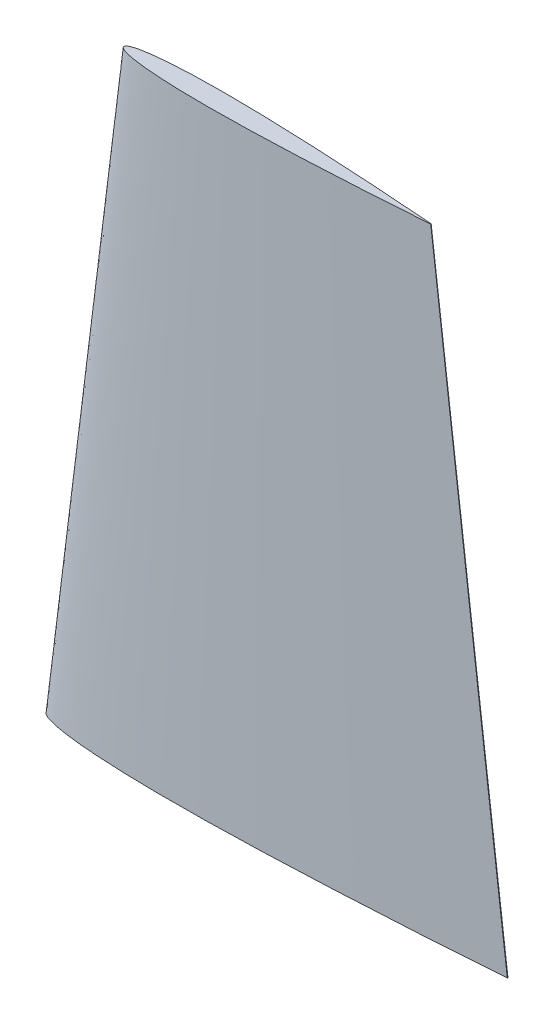
ISO-10303-21;
HEADER;
FILE_DESCRIPTION(('STEP AP214'),'2;1');
FILE_NAME('part.step','',(''),(''),'','','');
FILE_SCHEMA(('AUTOMOTIVE_DESIGN { 1 0 10303 214 1 1 1 1 }'));
ENDSEC;
DATA;
#1=APPLICATION_CONTEXT('core data for automotive mechanical design processes');
#2=APPLICATION_PROTOCOL_DEFINITION('international standard','automotive_design',2000,#1);
#3=PRODUCT_CONTEXT('',#1,'mechanical');
#4=PRODUCT('Part','Part','',(#3));
#5=PRODUCT_RELATED_PRODUCT_CATEGORY('part','',(#4));
#6=PRODUCT_DEFINITION_FORMATION('','',#4);
#7=PRODUCT_DEFINITION_CONTEXT('part definition',#1,'design');
#8=PRODUCT_DEFINITION('design','',#6,#7);
#9=PRODUCT_DEFINITION_SHAPE('','',#8);
#10=(LENGTH_UNIT() NAMED_UNIT(*) SI_UNIT(.MILLI.,.METRE.));
#11=(NAMED_UNIT(*) PLANE_ANGLE_UNIT() SI_UNIT($,.RADIAN.));
#12=(NAMED_UNIT(*) SI_UNIT($,.STERADIAN.) SOLID_ANGLE_UNIT());
#13=UNCERTAINTY_MEASURE_WITH_UNIT(LENGTH_MEASURE(1.E-05),#10,'distance_accuracy_value','');
#14=(GEOMETRIC_REPRESENTATION_CONTEXT(3) GLOBAL_UNCERTAINTY_ASSIGNED_CONTEXT((#13)) GLOBAL_UNIT_ASSIGNED_CONTEXT((#10,
#11,#12)) REPRESENTATION_CONTEXT('',''));
#15=CARTESIAN_POINT('',(0.,0.,0.));
#16=DIRECTION('',(0.,0.,1.));
#17=DIRECTION('',(1.,0.,0.));
#18=AXIS2_PLACEMENT_3D('',#15,#16,#17);
#19=CARTESIAN_POINT('',(1.83940168689774E-07,0.,-0.000524189513870384));
#20=DIRECTION('',(0.,-1.,0.));
#21=DIRECTION('',(0.,0.,-1.));
#22=AXIS2_PLACEMENT_3D('',#19,#20,#21);
#23=PLANE('',#22);
#24=CARTESIAN_POINT('',(182.88,0.,0.));
#25=CARTESIAN_POINT('',(175.580480806622,0.,-0.573766416117492));
#26=CARTESIAN_POINT('',(161.030949439601,0.,-1.63345792068158));
#27=CARTESIAN_POINT('',(137.667446898645,0.,-3.12140371854652));
#28=CARTESIAN_POINT('',(114.490768862938,0.,-4.37437292438721));
#29=CARTESIAN_POINT('',(93.7947606135728,0.,-5.25921932172639));
#30=CARTESIAN_POINT('',(77.2591894759888,0.,-5.7721653930765));
#31=CARTESIAN_POINT('',(63.4207811829887,0.,-6.03524150473399));
#32=CARTESIAN_POINT('',(50.2712140298931,0.,-6.08372482474203));
#33=CARTESIAN_POINT('',(39.8934746560877,0.,-5.91997614580218));
#34=CARTESIAN_POINT('',(32.1787941939408,0.,-5.6507212391836));
#35=CARTESIAN_POINT('',(26.9164027226709,0.,-5.39097577930849));
#36=CARTESIAN_POINT('',(22.0515337628295,0.,-5.07090762765687));
#37=CARTESIAN_POINT('',(17.6140766878622,0.,-4.69273513874642));
#38=CARTESIAN_POINT('',(13.6311972065962,0.,-4.26090846810219));
#39=CARTESIAN_POINT('',(10.127116771715,0.,-3.78023134478052));
#40=CARTESIAN_POINT('',(7.12224254816708,0.,-3.25691634335536));
#41=CARTESIAN_POINT('',(4.63498487792526,0.,-2.69434467942644));
#42=CARTESIAN_POINT('',(2.67193779377363,0.,-2.10685773708246));
#43=CARTESIAN_POINT('',(1.24509581340661,0.,-1.48016921495097));
#44=CARTESIAN_POINT('',(0.29945101007596,0.,-0.849237868320381));
#45=CARTESIAN_POINT('',(-0.122808939294547,0.,-0.000610385099385517));
#46=CARTESIAN_POINT('',(0.2982593485676,0.,0.848609001794949));
#47=CARTESIAN_POINT('',(1.24301756174951,0.,1.48086715860479));
#48=CARTESIAN_POINT('',(2.66897843366522,0.,2.10955796693179));
#49=CARTESIAN_POINT('',(4.6311989095877,0.,2.69979992231242));
#50=CARTESIAN_POINT('',(7.1176644295028,0.,3.26586247495644));
#51=CARTESIAN_POINT('',(10.1218010985816,0.,3.79339499865078));
#52=CARTESIAN_POINT('',(13.6252033393101,0.,4.27899043794197));
#53=CARTESIAN_POINT('',(17.6074727276348,0.,4.71640757818831));
#54=CARTESIAN_POINT('',(22.044394577884,0.,5.10080869464002));
#55=CARTESIAN_POINT('',(28.7853554703226,0.,5.55381253072489));
#56=CARTESIAN_POINT('',(38.1256474857431,0.,5.94456819235311));
#57=CARTESIAN_POINT('',(50.2626324369287,0.,6.15324199159419));
#58=CARTESIAN_POINT('',(63.4122548250381,0.,6.12313084548827));
#59=CARTESIAN_POINT('',(79.6438269367082,0.,5.8373101193261));
#60=CARTESIAN_POINT('',(96.1788180724682,0.,5.29828779336364));
#61=CARTESIAN_POINT('',(114.784750555529,0.,4.4985976066467));
#62=CARTESIAN_POINT('',(132.189878350185,0.,3.60647808022916));
#63=CARTESIAN_POINT('',(153.237185546575,0.,2.36480086659926));
#64=CARTESIAN_POINT('',(169.784805206288,0.,1.24513458658543));
#65=CARTESIAN_POINT('',(180.465932667493,0.,0.441996693435753));
#66=CARTESIAN_POINT('',(182.785876293372,0.,0.262917772123367));
#67=CARTESIAN_POINT('',(182.879820556569,0.,0.255666114311909));
#68=B_SPLINE_CURVE_WITH_KNOTS('',3,(#24,#25,#26,#27,#28,#29,#30,#31,#32,#33,#34,#35,#36,#37,#38,
#39,#40,#41,#42,#43,#44,#45,#46,#47,#48,#49,#50,#51,#52,#53,#54,#55,#56,#57,#58,#59,#60,#61,#62,
#63,#64,#65,#66,#67),.UNSPECIFIED.,.F.,.F.,(4,1,1,1,1,1,1,1,1,1,1,1,1,1,1,1,1,1,1,1,1,1,1,1,1,1,
1,1,1,1,1,1,1,1,1,1,1,1,1,1,1,4),(0.,0.0596259329175186,0.118794316145622,0.190640969797917,
0.248634388187655,0.287480222013132,0.325358639441238,0.361342977619647,0.394558133703493,
0.409873175250072,0.424202725033005,0.437462162530302,0.44957308952056,0.460466924896069,
0.470082555788664,0.478371165069195,0.485296058318901,0.490841915805551,0.495027345223261,
0.497956576323911,0.5,0.502043423676089,0.504972654776739,0.509158084194449,0.514703941681099,
0.521628834930805,0.529917444211336,0.539533075103931,0.55042691047944,0.562537837469698,
0.575797274966995,0.605441866296506,0.638657022380353,0.674641360558762,0.712519777986868,
0.770853679587024,0.809359030202083,0.864173424708743,0.912774372266273,0.981051672806997,
0.999232702632466,1.),.UNSPECIFIED.);
#69=CARTESIAN_POINT('',(182.88,0.,0.));
#70=VERTEX_POINT('',#69);
#71=CARTESIAN_POINT('',(182.879820556569,0.,0.255666114311895));
#72=VERTEX_POINT('',#71);
#73=EDGE_CURVE('E45',#70,#72,#68,.T.);
#74=ORIENTED_EDGE('',*,*,#73,.F.);
#75=DIRECTION('',(0.00070186613205372,0.,-0.999999753691936));
#76=VECTOR('',#75,1.);
#77=CARTESIAN_POINT('',(182.88,0.,0.));
#78=LINE('',#77,#76);
#79=EDGE_CURVE('E11',#72,#70,#78,.T.);
#80=ORIENTED_EDGE('',*,*,#79,.F.);
#81=EDGE_LOOP('',(#74,#80));
#82=FACE_BOUND('',#81,.T.);
#83=ADVANCED_FACE('F38',(#82),#23,.T.);
#84=CARTESIAN_POINT('',(30.4800001226268,243.84,-0.000349459676375938));
#85=DIRECTION('',(0.,-1.,0.));
#86=DIRECTION('',(0.,0.,-1.));
#87=AXIS2_PLACEMENT_3D('',#84,#85,#86);
#88=PLANE('',#87);
#89=CARTESIAN_POINT('',(152.4,243.84,-4.85736028273493E-13));
#90=CARTESIAN_POINT('',(147.533653871082,243.84,-0.382510944078857));
#91=CARTESIAN_POINT('',(137.833966293067,243.84,-1.08897194712135));
#92=CARTESIAN_POINT('',(122.258297932429,243.84,-2.08093581236535));
#93=CARTESIAN_POINT('',(106.807179241957,243.84,-2.91624861625855));
#94=CARTESIAN_POINT('',(93.009840409047,243.84,-3.50614621448439));
#95=CARTESIAN_POINT('',(81.9861263173245,243.84,-3.84811026205118));
#96=CARTESIAN_POINT('',(72.7605207886577,243.84,-4.02349433648963));
#97=CARTESIAN_POINT('',(63.994142686594,243.84,-4.05581654982898));
#98=CARTESIAN_POINT('',(57.0756497707236,243.84,-3.94665076386875));
#99=CARTESIAN_POINT('',(51.9325294626257,243.84,-3.76714749278944));
#100=CARTESIAN_POINT('',(48.4242684817791,243.84,-3.59398385287269));
#101=CARTESIAN_POINT('',(45.1810225085514,243.84,-3.38060508510465));
#102=CARTESIAN_POINT('',(42.2227177919066,243.84,-3.12849009249767));
#103=CARTESIAN_POINT('',(39.5674648043959,243.84,-2.84060564540152));
#104=CARTESIAN_POINT('',(37.2314111811434,243.84,-2.52015422985375));
#105=CARTESIAN_POINT('',(35.2281616987781,243.84,-2.17127756223698));
#106=CARTESIAN_POINT('',(33.5699899186169,243.84,-1.79622978628434));
#107=CARTESIAN_POINT('',(32.2612918625158,243.84,-1.40457182472169));
#108=CARTESIAN_POINT('',(31.3100638756045,243.84,-0.986779476634038));
#109=CARTESIAN_POINT('',(30.6796340067174,243.84,-0.566158578880752));
#110=CARTESIAN_POINT('',(30.3981273738036,243.84,-0.000406923400051235));
#111=CARTESIAN_POINT('',(30.6788395657118,243.84,0.565739334529532));
#112=CARTESIAN_POINT('',(31.3086783744998,243.84,0.987244772402758));
#113=CARTESIAN_POINT('',(32.2593189557769,243.84,1.4063719779541));
#114=CARTESIAN_POINT('',(33.5674659397252,243.84,1.79986661487453));
#115=CARTESIAN_POINT('',(35.2251096196686,243.84,2.17724164997058));
#116=CARTESIAN_POINT('',(37.2278673990544,243.84,2.52892999910013));
#117=CARTESIAN_POINT('',(39.5634688928718,243.84,2.85266029196094));
#118=CARTESIAN_POINT('',(42.2183151517549,243.84,3.14427171879184));
#119=CARTESIAN_POINT('',(45.176263051921,243.84,3.40053912975966));
#120=CARTESIAN_POINT('',(49.6702369802135,243.84,3.70254168714953));
#121=CARTESIAN_POINT('',(55.8970983238272,243.84,3.96304546156835));
#122=CARTESIAN_POINT('',(63.9884216246176,243.84,4.10216132772875));
#123=CARTESIAN_POINT('',(72.7548365500239,243.84,4.08208723032537));
#124=CARTESIAN_POINT('',(83.5758846244707,243.84,3.89154007955057));
#125=CARTESIAN_POINT('',(94.5992120483107,243.84,3.53219186224226));
#126=CARTESIAN_POINT('',(107.003167037018,243.84,2.99906507109761));
#127=CARTESIAN_POINT('',(118.606585566789,243.84,2.40431872015218));
#128=CARTESIAN_POINT('',(132.638123697716,243.84,1.57653391106554));
#129=CARTESIAN_POINT('',(143.669870137525,243.84,0.830089724389712));
#130=CARTESIAN_POINT('',(150.790621778329,243.84,0.294664462289999));
#131=CARTESIAN_POINT('',(152.337250862248,243.84,0.175278514748425));
#132=CARTESIAN_POINT('',(152.399880371046,243.84,0.170444076207435));
#133=B_SPLINE_CURVE_WITH_KNOTS('',3,(#89,#90,#91,#92,#93,#94,#95,#96,#97,#98,#99,#100,#101,#102,
#103,#104,#105,#106,#107,#108,#109,#110,#111,#112,#113,#114,#115,#116,#117,#118,#119,#120,#121,
#122,#123,#124,#125,#126,#127,#128,#129,#130,#131,#132),.UNSPECIFIED.,.F.,.F.,(4,1,1,1,1,1,1,1,
1,1,1,1,1,1,1,1,1,1,1,1,1,1,1,1,1,1,1,1,1,1,1,1,1,1,1,1,1,1,1,1,1,4),(0.,0.0596259329175186,
0.118794316145622,0.190640969797917,0.248634388187655,0.287480222013132,0.325358639441238,
0.361342977619647,0.394558133703493,0.409873175250072,0.424202725033005,0.437462162530302,
0.44957308952056,0.460466924896069,0.470082555788664,0.478371165069195,0.485296058318901,
0.490841915805551,0.495027345223261,0.497956576323911,0.5,0.502043423676089,0.504972654776739,
0.509158084194449,0.514703941681099,0.521628834930805,0.529917444211336,0.539533075103931,
0.55042691047944,0.562537837469698,0.575797274966995,0.605441866296506,0.638657022380353,
0.674641360558762,0.712519777986868,0.770853679587024,0.809359030202083,0.864173424708743,
0.912774372266273,0.981051672806997,0.999232702632466,1.),.UNSPECIFIED.);
#134=CARTESIAN_POINT('',(152.4,243.84,-2.4980018054066E-13));
#135=VERTEX_POINT('',#134);
#136=CARTESIAN_POINT('',(152.399880371046,243.84,0.170444076207671));
#137=VERTEX_POINT('',#136);
#138=EDGE_CURVE('E66',#135,#137,#133,.T.);
#139=ORIENTED_EDGE('',*,*,#138,.T.);
#140=DIRECTION('',(0.000701866132053797,0.,-0.999999753691936));
#141=VECTOR('',#140,1.);
#142=CARTESIAN_POINT('',(152.4,243.84,-2.4980018054066E-13));
#143=LINE('',#142,#141);
#144=EDGE_CURVE('E64',#137,#135,#143,.T.);
#145=ORIENTED_EDGE('',*,*,#144,.T.);
#146=EDGE_LOOP('',(#139,#145));
#147=FACE_BOUND('',#146,.T.);
#148=ADVANCED_FACE('F65',(#147),#88,.F.);
#149=CARTESIAN_POINT('',(180.0663741995,22.5082967749375,0.126382520701375));
#150=DIRECTION('',(0.992277636067717,0.124034704508465,0.000696446237890582));
#151=DIRECTION('',(-0.124034734589208,0.992277876713668,0.));
#152=AXIS2_PLACEMENT_3D('',#149,#150,#151);
#153=PLANE('',#152);
#154=DIRECTION('',(0.124034487467165,-0.99227784700046,0.000346800937036789));
#155=VECTOR('',#154,1.);
#156=CARTESIAN_POINT('',(152.399880371046,243.84,0.170444076207671));
#157=LINE('',#156,#155);
#158=EDGE_CURVE('E69',#137,#72,#157,.T.);
#159=ORIENTED_EDGE('',*,*,#158,.T.);
#160=ORIENTED_EDGE('',*,*,#79,.T.);
#161=DIRECTION('',(0.124034734589208,-0.992277876713668,0.));
#162=VECTOR('',#161,1.);
#163=CARTESIAN_POINT('',(152.4,243.84,-2.4980018054066E-13));
#164=LINE('',#163,#162);
#165=EDGE_CURVE('E56',#135,#70,#164,.T.);
#166=ORIENTED_EDGE('',*,*,#165,.F.);
#167=ORIENTED_EDGE('',*,*,#144,.F.);
#168=EDGE_LOOP('',(#159,#160,#166,#167));
#169=FACE_BOUND('',#168,.T.);
#170=ADVANCED_FACE('F73',(#169),#153,.T.);
#171=CARTESIAN_POINT('',(152.399880371046,243.84,0.170444076207435));
#172=CARTESIAN_POINT('',(182.879820556569,0.,0.255666114311909));
#173=CARTESIAN_POINT('',(152.337250862248,243.84,0.175278514748425));
#174=CARTESIAN_POINT('',(182.785876293372,0.,0.262917772123367));
#175=CARTESIAN_POINT('',(150.790621778329,243.84,0.294664462289999));
#176=CARTESIAN_POINT('',(180.465932667493,0.,0.441996693435753));
#177=CARTESIAN_POINT('',(143.669870137525,243.84,0.830089724389712));
#178=CARTESIAN_POINT('',(169.784805206288,0.,1.24513458658543));
#179=CARTESIAN_POINT('',(132.638123697716,243.84,1.57653391106554));
#180=CARTESIAN_POINT('',(153.237185546575,0.,2.36480086659926));
#181=CARTESIAN_POINT('',(118.606585566789,243.84,2.40431872015218));
#182=CARTESIAN_POINT('',(132.189878350185,0.,3.60647808022916));
#183=CARTESIAN_POINT('',(107.003167037018,243.84,2.99906507109761));
#184=CARTESIAN_POINT('',(114.784750555529,0.,4.4985976066467));
#185=CARTESIAN_POINT('',(94.5992120483107,243.84,3.53219186224226));
#186=CARTESIAN_POINT('',(96.1788180724682,0.,5.29828779336364));
#187=CARTESIAN_POINT('',(83.5758846244707,243.84,3.89154007955057));
#188=CARTESIAN_POINT('',(79.6438269367082,0.,5.8373101193261));
#189=CARTESIAN_POINT('',(72.7548365500239,243.84,4.08208723032537));
#190=CARTESIAN_POINT('',(63.4122548250381,0.,6.12313084548827));
#191=CARTESIAN_POINT('',(63.9884216246176,243.84,4.10216132772875));
#192=CARTESIAN_POINT('',(50.2626324369287,0.,6.15324199159419));
#193=CARTESIAN_POINT('',(55.8970983238272,243.84,3.96304546156835));
#194=CARTESIAN_POINT('',(38.1256474857431,0.,5.94456819235311));
#195=CARTESIAN_POINT('',(49.6702369802135,243.84,3.70254168714953));
#196=CARTESIAN_POINT('',(28.7853554703226,0.,5.55381253072489));
#197=CARTESIAN_POINT('',(45.176263051921,243.84,3.40053912975966));
#198=CARTESIAN_POINT('',(22.044394577884,0.,5.10080869464002));
#199=CARTESIAN_POINT('',(42.2183151517549,243.84,3.14427171879184));
#200=CARTESIAN_POINT('',(17.6074727276348,0.,4.71640757818831));
#201=CARTESIAN_POINT('',(39.5634688928718,243.84,2.85266029196094));
#202=CARTESIAN_POINT('',(13.6252033393101,0.,4.27899043794197));
#203=CARTESIAN_POINT('',(37.2278673990544,243.84,2.52892999910013));
#204=CARTESIAN_POINT('',(10.1218010985816,0.,3.79339499865078));
#205=CARTESIAN_POINT('',(35.2251096196686,243.84,2.17724164997058));
#206=CARTESIAN_POINT('',(7.1176644295028,0.,3.26586247495644));
#207=CARTESIAN_POINT('',(33.5674659397252,243.84,1.79986661487453));
#208=CARTESIAN_POINT('',(4.6311989095877,0.,2.69979992231242));
#209=CARTESIAN_POINT('',(32.2593189557769,243.84,1.4063719779541));
#210=CARTESIAN_POINT('',(2.66897843366522,0.,2.10955796693179));
#211=CARTESIAN_POINT('',(31.3086783744998,243.84,0.987244772402758));
#212=CARTESIAN_POINT('',(1.24301756174951,0.,1.48086715860479));
#213=CARTESIAN_POINT('',(30.6788395657118,243.84,0.565739334529532));
#214=CARTESIAN_POINT('',(0.2982593485676,0.,0.848609001794949));
#215=CARTESIAN_POINT('',(30.3981273738036,243.84,-0.000406923400051235));
#216=CARTESIAN_POINT('',(-0.122808939294547,0.,-0.000610385099385517));
#217=CARTESIAN_POINT('',(30.6796340067174,243.84,-0.566158578880752));
#218=CARTESIAN_POINT('',(0.29945101007596,0.,-0.849237868320381));
#219=CARTESIAN_POINT('',(31.3100638756045,243.84,-0.986779476634038));
#220=CARTESIAN_POINT('',(1.24509581340661,0.,-1.48016921495097));
#221=CARTESIAN_POINT('',(32.2612918625158,243.84,-1.40457182472169));
#222=CARTESIAN_POINT('',(2.67193779377363,0.,-2.10685773708246));
#223=CARTESIAN_POINT('',(33.5699899186169,243.84,-1.79622978628434));
#224=CARTESIAN_POINT('',(4.63498487792526,0.,-2.69434467942644));
#225=CARTESIAN_POINT('',(35.2281616987781,243.84,-2.17127756223698));
#226=CARTESIAN_POINT('',(7.12224254816708,0.,-3.25691634335536));
#227=CARTESIAN_POINT('',(37.2314111811434,243.84,-2.52015422985375));
#228=CARTESIAN_POINT('',(10.127116771715,0.,-3.78023134478052));
#229=CARTESIAN_POINT('',(39.5674648043959,243.84,-2.84060564540152));
#230=CARTESIAN_POINT('',(13.6311972065962,0.,-4.26090846810219));
#231=CARTESIAN_POINT('',(42.2227177919066,243.84,-3.12849009249767));
#232=CARTESIAN_POINT('',(17.6140766878622,0.,-4.69273513874642));
#233=CARTESIAN_POINT('',(45.1810225085514,243.84,-3.38060508510465));
#234=CARTESIAN_POINT('',(22.0515337628295,0.,-5.07090762765687));
#235=CARTESIAN_POINT('',(48.4242684817791,243.84,-3.59398385287269));
#236=CARTESIAN_POINT('',(26.9164027226709,0.,-5.39097577930849));
#237=CARTESIAN_POINT('',(51.9325294626257,243.84,-3.76714749278944));
#238=CARTESIAN_POINT('',(32.1787941939408,0.,-5.6507212391836));
#239=CARTESIAN_POINT('',(57.0756497707236,243.84,-3.94665076386875));
#240=CARTESIAN_POINT('',(39.8934746560877,0.,-5.91997614580218));
#241=CARTESIAN_POINT('',(63.994142686594,243.84,-4.05581654982898));
#242=CARTESIAN_POINT('',(50.2712140298931,0.,-6.08372482474203));
#243=CARTESIAN_POINT('',(72.7605207886577,243.84,-4.02349433648963));
#244=CARTESIAN_POINT('',(63.4207811829887,0.,-6.03524150473399));
#245=CARTESIAN_POINT('',(81.9861263173245,243.84,-3.84811026205118));
#246=CARTESIAN_POINT('',(77.2591894759888,0.,-5.7721653930765));
#247=CARTESIAN_POINT('',(93.009840409047,243.84,-3.50614621448439));
#248=CARTESIAN_POINT('',(93.7947606135728,0.,-5.25921932172639));
#249=CARTESIAN_POINT('',(106.807179241957,243.84,-2.91624861625855));
#250=CARTESIAN_POINT('',(114.490768862938,0.,-4.37437292438721));
#251=CARTESIAN_POINT('',(122.258297932429,243.84,-2.08093581236535));
#252=CARTESIAN_POINT('',(137.667446898645,0.,-3.12140371854652));
#253=CARTESIAN_POINT('',(137.833966293067,243.84,-1.08897194712135));
#254=CARTESIAN_POINT('',(161.030949439601,0.,-1.63345792068158));
#255=CARTESIAN_POINT('',(147.533653871082,243.84,-0.382510944078857));
#256=CARTESIAN_POINT('',(175.580480806622,0.,-0.573766416117492));
#257=CARTESIAN_POINT('',(152.4,243.84,-4.85736028273493E-13));
#258=CARTESIAN_POINT('',(182.88,0.,0.));
#259=B_SPLINE_SURFACE_WITH_KNOTS('',3,1,((#171,#172),(#173,#174),(#175,#176),(#177,#178),(#179,
#180),(#181,#182),(#183,#184),(#185,#186),(#187,#188),(#189,#190),(#191,#192),(#193,#194),(#195,
#196),(#197,#198),(#199,#200),(#201,#202),(#203,#204),(#205,#206),(#207,#208),(#209,#210),(#211,
#212),(#213,#214),(#215,#216),(#217,#218),(#219,#220),(#221,#222),(#223,#224),(#225,#226),(#227,
#228),(#229,#230),(#231,#232),(#233,#234),(#235,#236),(#237,#238),(#239,#240),(#241,#242),(#243,
#244),(#245,#246),(#247,#248),(#249,#250),(#251,#252),(#253,#254),(#255,#256),(#257,#258)),
.UNSPECIFIED.,.F.,.F.,.F.,(4,1,1,1,1,1,1,1,1,1,1,1,1,1,1,1,1,1,1,1,1,1,1,1,1,1,1,1,1,1,1,1,1,1,
1,1,1,1,1,1,1,4),(2,2),(0.,0.000767297367533559,0.0189483271930031,0.0872256277337271,
0.135826575291257,0.190640969797917,0.229146320412976,0.287480222013132,0.325358639441238,
0.361342977619647,0.394558133703494,0.424202725033005,0.437462162530302,0.44957308952056,
0.460466924896069,0.470082555788664,0.478371165069195,0.485296058318901,0.490841915805551,
0.495027345223261,0.497956576323911,0.5,0.502043423676089,0.504972654776739,0.509158084194449,
0.514703941681099,0.521628834930805,0.529917444211336,0.539533075103931,0.55042691047944,
0.562537837469698,0.575797274966995,0.590126824749928,0.605441866296507,0.638657022380353,
0.674641360558762,0.712519777986868,0.751365611812345,0.809359030202083,0.881205683854378,
0.940374067082481,1.),(0.,1.),.UNSPECIFIED.);
#260=ORIENTED_EDGE('',*,*,#138,.F.);
#261=ORIENTED_EDGE('',*,*,#165,.T.);
#262=ORIENTED_EDGE('',*,*,#73,.T.);
#263=ORIENTED_EDGE('',*,*,#158,.F.);
#264=EDGE_LOOP('',(#260,#261,#262,#263));
#265=FACE_BOUND('',#264,.T.);
#266=ADVANCED_FACE('F71',(#265),#259,.T.);
#267=CLOSED_SHELL('',(#83,#148,#170,#266));
#268=MANIFOLD_SOLID_BREP('B2',#267);
#269=ADVANCED_BREP_SHAPE_REPRESENTATION('',(#18,#268),#14);
#270=SHAPE_DEFINITION_REPRESENTATION(#9,#269);
ENDSEC;
END-ISO-10303-21;
